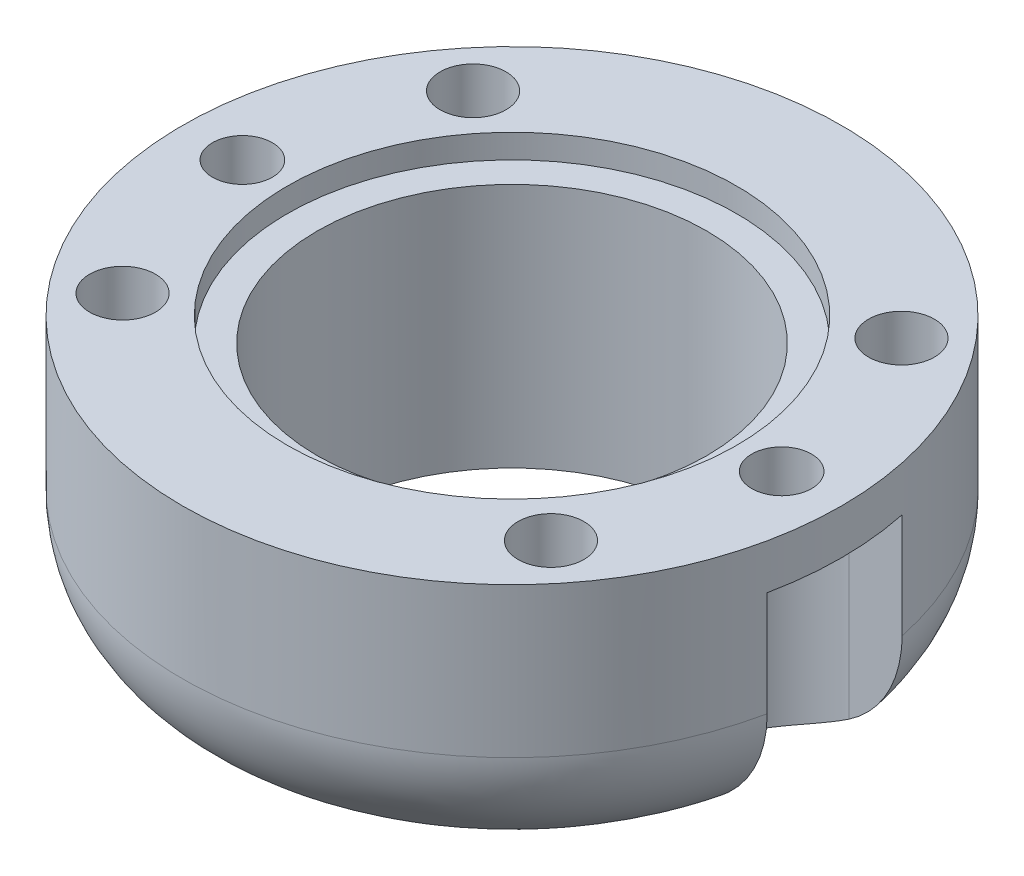
ISO-10303-21;
HEADER;
FILE_DESCRIPTION(('STEP AP214'),'2;1');
FILE_NAME('part.step','',(''),(''),'','','');
FILE_SCHEMA(('AUTOMOTIVE_DESIGN { 1 0 10303 214 1 1 1 1 }'));
ENDSEC;
DATA;
#1=APPLICATION_CONTEXT('core data for automotive mechanical design processes');
#2=APPLICATION_PROTOCOL_DEFINITION('international standard','automotive_design',2000,#1);
#3=PRODUCT_CONTEXT('',#1,'mechanical');
#4=PRODUCT('Part','Part','',(#3));
#5=PRODUCT_RELATED_PRODUCT_CATEGORY('part','',(#4));
#6=PRODUCT_DEFINITION_FORMATION('','',#4);
#7=PRODUCT_DEFINITION_CONTEXT('part definition',#1,'design');
#8=PRODUCT_DEFINITION('design','',#6,#7);
#9=PRODUCT_DEFINITION_SHAPE('','',#8);
#10=(LENGTH_UNIT() NAMED_UNIT(*) SI_UNIT(.MILLI.,.METRE.));
#11=(NAMED_UNIT(*) PLANE_ANGLE_UNIT() SI_UNIT($,.RADIAN.));
#12=(NAMED_UNIT(*) SI_UNIT($,.STERADIAN.) SOLID_ANGLE_UNIT());
#13=UNCERTAINTY_MEASURE_WITH_UNIT(LENGTH_MEASURE(1.E-05),#10,'distance_accuracy_value','');
#14=(GEOMETRIC_REPRESENTATION_CONTEXT(3) GLOBAL_UNCERTAINTY_ASSIGNED_CONTEXT((#13)) GLOBAL_UNIT_ASSIGNED_CONTEXT((#10,
#11,#12)) REPRESENTATION_CONTEXT('',''));
#15=CARTESIAN_POINT('',(0.,0.,0.));
#16=DIRECTION('',(0.,0.,1.));
#17=DIRECTION('',(1.,0.,0.));
#18=AXIS2_PLACEMENT_3D('',#15,#16,#17);
#19=CARTESIAN_POINT('',(0.,9.,0.));
#20=DIRECTION('',(0.,1.,0.));
#21=DIRECTION('',(0.,0.,1.));
#22=AXIS2_PLACEMENT_3D('',#19,#20,#21);
#23=PLANE('',#22);
#24=CARTESIAN_POINT('',(-7.15,9.,-5.85));
#25=DIRECTION('',(0.,1.,0.));
#26=DIRECTION('',(0.,0.,1.));
#27=AXIS2_PLACEMENT_3D('',#24,#25,#26);
#28=CIRCLE('',#27,1.1);
#29=CARTESIAN_POINT('',(-7.15,9.,-4.75));
#30=VERTEX_POINT('',#29);
#31=EDGE_CURVE('E211',#30,#30,#28,.T.);
#32=ORIENTED_EDGE('',*,*,#31,.F.);
#33=EDGE_LOOP('',(#32));
#34=FACE_BOUND('',#33,.T.);
#35=CARTESIAN_POINT('',(-7.15,9.,5.85));
#36=DIRECTION('',(0.,1.,0.));
#37=DIRECTION('',(0.,0.,-1.));
#38=AXIS2_PLACEMENT_3D('',#35,#36,#37);
#39=CIRCLE('',#38,1.1);
#40=CARTESIAN_POINT('',(-7.15,9.,4.75));
#41=VERTEX_POINT('',#40);
#42=EDGE_CURVE('E212',#41,#41,#39,.T.);
#43=ORIENTED_EDGE('',*,*,#42,.F.);
#44=EDGE_LOOP('',(#43));
#45=FACE_BOUND('',#44,.T.);
#46=CARTESIAN_POINT('',(7.15,9.,5.85));
#47=DIRECTION('',(0.,1.,0.));
#48=DIRECTION('',(0.,0.,1.));
#49=AXIS2_PLACEMENT_3D('',#46,#47,#48);
#50=CIRCLE('',#49,1.1);
#51=CARTESIAN_POINT('',(7.15,9.,6.95));
#52=VERTEX_POINT('',#51);
#53=EDGE_CURVE('E220',#52,#52,#50,.T.);
#54=ORIENTED_EDGE('',*,*,#53,.F.);
#55=EDGE_LOOP('',(#54));
#56=FACE_BOUND('',#55,.T.);
#57=CARTESIAN_POINT('',(7.15,9.,-5.85));
#58=DIRECTION('',(0.,1.,0.));
#59=DIRECTION('',(0.,0.,-1.));
#60=AXIS2_PLACEMENT_3D('',#57,#58,#59);
#61=CIRCLE('',#60,1.1);
#62=CARTESIAN_POINT('',(7.15,9.,-6.95));
#63=VERTEX_POINT('',#62);
#64=EDGE_CURVE('E203',#63,#63,#61,.T.);
#65=ORIENTED_EDGE('',*,*,#64,.F.);
#66=EDGE_LOOP('',(#65));
#67=FACE_BOUND('',#66,.T.);
#68=CARTESIAN_POINT('',(9.,9.,0.));
#69=DIRECTION('',(0.,1.,0.));
#70=DIRECTION('',(0.,0.,-1.));
#71=AXIS2_PLACEMENT_3D('',#68,#69,#70);
#72=CIRCLE('',#71,1.);
#73=CARTESIAN_POINT('',(9.,9.,-1.));
#74=VERTEX_POINT('',#73);
#75=EDGE_CURVE('E198',#74,#74,#72,.T.);
#76=ORIENTED_EDGE('',*,*,#75,.F.);
#77=EDGE_LOOP('',(#76));
#78=FACE_BOUND('',#77,.T.);
#79=CARTESIAN_POINT('',(-9.,9.,0.));
#80=DIRECTION('',(0.,1.,0.));
#81=DIRECTION('',(0.,0.,1.));
#82=AXIS2_PLACEMENT_3D('',#79,#80,#81);
#83=CIRCLE('',#82,1.);
#84=CARTESIAN_POINT('',(-9.,9.,1.));
#85=VERTEX_POINT('',#84);
#86=EDGE_CURVE('E199',#85,#85,#83,.T.);
#87=ORIENTED_EDGE('',*,*,#86,.F.);
#88=EDGE_LOOP('',(#87));
#89=FACE_BOUND('',#88,.T.);
#90=CARTESIAN_POINT('',(0.,9.,0.));
#91=DIRECTION('',(0.,1.,0.));
#92=DIRECTION('',(0.,0.,1.));
#93=AXIS2_PLACEMENT_3D('',#90,#91,#92);
#94=CIRCLE('',#93,7.5);
#95=CARTESIAN_POINT('',(0.,9.,7.5));
#96=VERTEX_POINT('',#95);
#97=EDGE_CURVE('E130',#96,#96,#94,.T.);
#98=ORIENTED_EDGE('',*,*,#97,.F.);
#99=EDGE_LOOP('',(#98));
#100=FACE_BOUND('',#99,.T.);
#101=CARTESIAN_POINT('',(0.,9.,0.));
#102=DIRECTION('',(0.,1.,0.));
#103=DIRECTION('',(0.,0.,1.));
#104=AXIS2_PLACEMENT_3D('',#101,#102,#103);
#105=CIRCLE('',#104,11.);
#106=CARTESIAN_POINT('',(0.,9.,11.));
#107=VERTEX_POINT('',#106);
#108=EDGE_CURVE('E242',#107,#107,#105,.T.);
#109=ORIENTED_EDGE('',*,*,#108,.T.);
#110=EDGE_LOOP('',(#109));
#111=FACE_BOUND('',#110,.T.);
#112=ADVANCED_FACE('F40',(#34,#45,#56,#67,#78,#89,#100,#111),#23,.T.);
#113=CARTESIAN_POINT('',(0.,0.,0.));
#114=DIRECTION('',(0.,1.,0.));
#115=DIRECTION('',(0.,0.,1.));
#116=AXIS2_PLACEMENT_3D('',#113,#114,#115);
#117=PLANE('',#116);
#118=CARTESIAN_POINT('',(0.,0.,0.));
#119=DIRECTION('',(0.,1.,0.));
#120=DIRECTION('',(0.,0.,1.));
#121=AXIS2_PLACEMENT_3D('',#118,#119,#120);
#122=CIRCLE('',#121,6.5);
#123=CARTESIAN_POINT('',(0.,0.,6.5));
#124=VERTEX_POINT('',#123);
#125=EDGE_CURVE('E235',#124,#124,#122,.T.);
#126=ORIENTED_EDGE('',*,*,#125,.T.);
#127=EDGE_LOOP('',(#126));
#128=FACE_BOUND('',#127,.T.);
#129=CARTESIAN_POINT('',(-9.,0.,0.));
#130=DIRECTION('',(0.,-1.,0.));
#131=DIRECTION('',(0.,0.,1.));
#132=AXIS2_PLACEMENT_3D('',#129,#130,#131);
#133=CIRCLE('',#132,2.25);
#134=CARTESIAN_POINT('',(-6.94097222222222,0.,-0.907140898835183));
#135=VERTEX_POINT('',#134);
#136=CARTESIAN_POINT('',(-6.94097222222222,0.,0.907140898835183));
#137=VERTEX_POINT('',#136);
#138=EDGE_CURVE('E159',#135,#137,#133,.T.);
#139=ORIENTED_EDGE('',*,*,#138,.F.);
#140=CARTESIAN_POINT('',(0.,0.,0.));
#141=DIRECTION('',(0.,1.,0.));
#142=DIRECTION('',(0.,0.,1.));
#143=AXIS2_PLACEMENT_3D('',#140,#141,#142);
#144=CIRCLE('',#143,7.);
#145=CARTESIAN_POINT('',(6.94097222222222,0.,-0.907140898835181));
#146=VERTEX_POINT('',#145);
#147=EDGE_CURVE('E559',#135,#146,#144,.F.);
#148=ORIENTED_EDGE('',*,*,#147,.T.);
#149=CARTESIAN_POINT('',(9.,0.,0.));
#150=DIRECTION('',(0.,-1.,0.));
#151=DIRECTION('',(0.,0.,-1.));
#152=AXIS2_PLACEMENT_3D('',#149,#150,#151);
#153=CIRCLE('',#152,2.25);
#154=CARTESIAN_POINT('',(6.94097222222222,0.,0.907140898835182));
#155=VERTEX_POINT('',#154);
#156=EDGE_CURVE('E172',#155,#146,#153,.T.);
#157=ORIENTED_EDGE('',*,*,#156,.F.);
#158=CARTESIAN_POINT('',(0.,0.,0.));
#159=DIRECTION('',(0.,1.,0.));
#160=DIRECTION('',(0.,0.,1.));
#161=AXIS2_PLACEMENT_3D('',#158,#159,#160);
#162=CIRCLE('',#161,7.);
#163=EDGE_CURVE('E582',#155,#137,#162,.F.);
#164=ORIENTED_EDGE('',*,*,#163,.T.);
#165=EDGE_LOOP('',(#139,#148,#157,#164));
#166=FACE_BOUND('',#165,.T.);
#167=ADVANCED_FACE('F330',(#128,#166),#117,.F.);
#168=CARTESIAN_POINT('',(-9.,7.5,0.));
#169=DIRECTION('',(0.,1.,0.));
#170=DIRECTION('',(0.,0.,1.));
#171=AXIS2_PLACEMENT_3D('',#168,#169,#170);
#172=PLANE('',#171);
#173=CARTESIAN_POINT('',(-9.,7.5,0.));
#174=DIRECTION('',(0.,1.,0.));
#175=DIRECTION('',(0.,0.,1.));
#176=AXIS2_PLACEMENT_3D('',#173,#174,#175);
#177=CIRCLE('',#176,1.);
#178=CARTESIAN_POINT('',(-9.,7.5,1.));
#179=VERTEX_POINT('',#178);
#180=EDGE_CURVE('E142',#179,#179,#177,.F.);
#181=ORIENTED_EDGE('',*,*,#180,.F.);
#182=EDGE_LOOP('',(#181));
#183=FACE_BOUND('',#182,.T.);
#184=CARTESIAN_POINT('',(0.,7.5,0.));
#185=DIRECTION('',(0.,1.,0.));
#186=DIRECTION('',(0.,0.,1.));
#187=AXIS2_PLACEMENT_3D('',#184,#185,#186);
#188=CIRCLE('',#187,11.);
#189=CARTESIAN_POINT('',(-10.767427733679,7.5,-2.25));
#190=VERTEX_POINT('',#189);
#191=CARTESIAN_POINT('',(-10.767427733679,7.5,2.25));
#192=VERTEX_POINT('',#191);
#193=EDGE_CURVE('E127',#190,#192,#188,.T.);
#194=ORIENTED_EDGE('',*,*,#193,.F.);
#195=DIRECTION('',(1.,0.,0.));
#196=VECTOR('',#195,1.);
#197=CARTESIAN_POINT('',(-9.,7.5,-2.25));
#198=LINE('',#197,#196);
#199=CARTESIAN_POINT('',(-9.,7.5,-2.25));
#200=VERTEX_POINT('',#199);
#201=EDGE_CURVE('E137',#190,#200,#198,.T.);
#202=ORIENTED_EDGE('',*,*,#201,.T.);
#203=CARTESIAN_POINT('',(-9.,7.5,0.));
#204=DIRECTION('',(0.,-1.,0.));
#205=DIRECTION('',(0.,0.,1.));
#206=AXIS2_PLACEMENT_3D('',#203,#204,#205);
#207=CIRCLE('',#206,2.25);
#208=CARTESIAN_POINT('',(-9.,7.5,2.25));
#209=VERTEX_POINT('',#208);
#210=EDGE_CURVE('E155',#200,#209,#207,.T.);
#211=ORIENTED_EDGE('',*,*,#210,.T.);
#212=DIRECTION('',(-1.,0.,0.));
#213=VECTOR('',#212,1.);
#214=CARTESIAN_POINT('',(-9.,7.5,2.25));
#215=LINE('',#214,#213);
#216=EDGE_CURVE('E139',#209,#192,#215,.T.);
#217=ORIENTED_EDGE('',*,*,#216,.T.);
#218=EDGE_LOOP('',(#194,#202,#211,#217));
#219=FACE_BOUND('',#218,.T.);
#220=ADVANCED_FACE('F135',(#183,#219),#172,.F.);
#221=CARTESIAN_POINT('',(-9.,7.5,-2.25));
#222=DIRECTION('',(0.,0.,-1.));
#223=DIRECTION('',(-1.,0.,0.));
#224=AXIS2_PLACEMENT_3D('',#221,#222,#223);
#225=PLANE('',#224);
#226=DIRECTION('',(0.,-1.,0.));
#227=VECTOR('',#226,1.);
#228=CARTESIAN_POINT('',(-10.767427733679,10.,-2.25));
#229=LINE('',#228,#227);
#230=CARTESIAN_POINT('',(-10.767427733679,4.,-2.25));
#231=VERTEX_POINT('',#230);
#232=EDGE_CURVE('E122',#231,#190,#229,.F.);
#233=ORIENTED_EDGE('',*,*,#232,.F.);
#234=CARTESIAN_POINT('',(-10.767427733679,4.,-2.25));
#235=CARTESIAN_POINT('',(-10.7674396072827,3.88937292476482,-2.25));
#236=CARTESIAN_POINT('',(-10.7627393881199,3.77875108381293,-2.25));
#237=CARTESIAN_POINT('',(-10.7440055240954,3.55830825916038,-2.25));
#238=CARTESIAN_POINT('',(-10.7299725521976,3.44848721829301,-2.25));
#239=CARTESIAN_POINT('',(-10.6927028884498,3.23064798338886,-2.25));
#240=CARTESIAN_POINT('',(-10.6694854850848,3.12262650235743,-2.25));
#241=CARTESIAN_POINT('',(-10.6140464855373,2.90894932622838,-2.25));
#242=CARTESIAN_POINT('',(-10.5818250087945,2.80329359976896,-2.25));
#243=CARTESIAN_POINT('',(-10.4719433816605,2.49086823827501,-2.25));
#244=CARTESIAN_POINT('',(-10.3810572288438,2.28858934429225,-2.25));
#245=CARTESIAN_POINT('',(-10.1667674400757,1.90201532512651,-2.25));
#246=CARTESIAN_POINT('',(-10.0433566307383,1.71772417948424,-2.25));
#247=CARTESIAN_POINT('',(-9.84151806339658,1.46450442934,-2.25));
#248=CARTESIAN_POINT('',(-9.77421789981565,1.38648382286098,-2.25));
#249=CARTESIAN_POINT('',(-9.63380145676216,1.23583337366697,-2.25));
#250=CARTESIAN_POINT('',(-9.56068529922734,1.16320341799364,-2.25));
#251=CARTESIAN_POINT('',(-9.40909727902006,1.02374663332172,-2.25));
#252=CARTESIAN_POINT('',(-9.33062435344717,0.956920962033146,-2.25));
#253=CARTESIAN_POINT('',(-9.16882761687672,0.829425994445518,-2.25));
#254=CARTESIAN_POINT('',(-9.08550384089006,0.768756653721947,-2.25));
#255=CARTESIAN_POINT('',(-9.,0.711333521477694,-2.25));
#256=B_SPLINE_CURVE_WITH_KNOTS('',3,(#234,#235,#236,#237,#238,#239,#240,#241,#242,#243,#244,
#245,#246,#247,#248,#249,#250,#251,#252,#253,#254,#255),.UNSPECIFIED.,.F.,.F.,(4,2,2,2,2,2,2,2,
2,2,4),(0.,0.331772170767974,0.663520420784995,0.994575624526256,1.32562643700634,
1.98757455085098,2.64966878119285,2.95853123327302,3.26738721146888,3.57630465261721,
3.88521986443671),.UNSPECIFIED.);
#257=CARTESIAN_POINT('',(-9.,0.711333521477693,-2.25));
#258=VERTEX_POINT('',#257);
#259=EDGE_CURVE('E55',#231,#258,#256,.T.);
#260=ORIENTED_EDGE('',*,*,#259,.T.);
#261=DIRECTION('',(0.,-1.,0.));
#262=VECTOR('',#261,1.);
#263=CARTESIAN_POINT('',(-9.,7.5,-2.25));
#264=LINE('',#263,#262);
#265=EDGE_CURVE('E145',#200,#258,#264,.T.);
#266=ORIENTED_EDGE('',*,*,#265,.F.);
#267=ORIENTED_EDGE('',*,*,#201,.F.);
#268=EDGE_LOOP('',(#233,#260,#266,#267));
#269=FACE_BOUND('',#268,.T.);
#270=ADVANCED_FACE('F144',(#269),#225,.F.);
#271=CARTESIAN_POINT('',(9.,7.5,0.));
#272=DIRECTION('',(0.,-1.,0.));
#273=DIRECTION('',(0.,0.,-1.));
#274=AXIS2_PLACEMENT_3D('',#271,#272,#273);
#275=PLANE('',#274);
#276=CARTESIAN_POINT('',(9.,7.5,0.));
#277=DIRECTION('',(0.,-1.,0.));
#278=DIRECTION('',(0.,0.,-1.));
#279=AXIS2_PLACEMENT_3D('',#276,#277,#278);
#280=CIRCLE('',#279,1.);
#281=CARTESIAN_POINT('',(9.,7.5,-1.));
#282=VERTEX_POINT('',#281);
#283=EDGE_CURVE('E141',#282,#282,#280,.F.);
#284=ORIENTED_EDGE('',*,*,#283,.T.);
#285=EDGE_LOOP('',(#284));
#286=FACE_BOUND('',#285,.T.);
#287=DIRECTION('',(1.,0.,0.));
#288=VECTOR('',#287,1.);
#289=CARTESIAN_POINT('',(9.,7.5,-2.25));
#290=LINE('',#289,#288);
#291=CARTESIAN_POINT('',(9.,7.5,-2.25));
#292=VERTEX_POINT('',#291);
#293=CARTESIAN_POINT('',(10.767427733679,7.5,-2.25));
#294=VERTEX_POINT('',#293);
#295=EDGE_CURVE('E176',#292,#294,#290,.T.);
#296=ORIENTED_EDGE('',*,*,#295,.T.);
#297=CARTESIAN_POINT('',(0.,7.5,0.));
#298=DIRECTION('',(0.,-1.,0.));
#299=DIRECTION('',(0.,0.,-1.));
#300=AXIS2_PLACEMENT_3D('',#297,#298,#299);
#301=CIRCLE('',#300,11.);
#302=CARTESIAN_POINT('',(10.767427733679,7.5,2.25));
#303=VERTEX_POINT('',#302);
#304=EDGE_CURVE('E195',#294,#303,#301,.T.);
#305=ORIENTED_EDGE('',*,*,#304,.T.);
#306=DIRECTION('',(-1.,0.,0.));
#307=VECTOR('',#306,1.);
#308=CARTESIAN_POINT('',(9.,7.5,2.25));
#309=LINE('',#308,#307);
#310=CARTESIAN_POINT('',(9.,7.5,2.25));
#311=VERTEX_POINT('',#310);
#312=EDGE_CURVE('E167',#303,#311,#309,.T.);
#313=ORIENTED_EDGE('',*,*,#312,.T.);
#314=CARTESIAN_POINT('',(9.,7.5,0.));
#315=DIRECTION('',(0.,-1.,0.));
#316=DIRECTION('',(0.,0.,-1.));
#317=AXIS2_PLACEMENT_3D('',#314,#315,#316);
#318=CIRCLE('',#317,2.25);
#319=EDGE_CURVE('E171',#311,#292,#318,.T.);
#320=ORIENTED_EDGE('',*,*,#319,.T.);
#321=EDGE_LOOP('',(#296,#305,#313,#320));
#322=FACE_BOUND('',#321,.T.);
#323=ADVANCED_FACE('F463',(#286,#322),#275,.T.);
#324=CARTESIAN_POINT('',(9.,7.5,-2.25));
#325=DIRECTION('',(0.,0.,-1.));
#326=DIRECTION('',(-1.,0.,0.));
#327=AXIS2_PLACEMENT_3D('',#324,#325,#326);
#328=PLANE('',#327);
#329=DIRECTION('',(0.,-1.,0.));
#330=VECTOR('',#329,1.);
#331=CARTESIAN_POINT('',(9.,7.5,-2.25));
#332=LINE('',#331,#330);
#333=CARTESIAN_POINT('',(9.,0.711333521477693,-2.25));
#334=VERTEX_POINT('',#333);
#335=EDGE_CURVE('E162',#292,#334,#332,.T.);
#336=ORIENTED_EDGE('',*,*,#335,.T.);
#337=CARTESIAN_POINT('',(9.,0.711333521477693,-2.25));
#338=CARTESIAN_POINT('',(9.0935506508423,0.774155673397265,-2.25));
#339=CARTESIAN_POINT('',(9.18449151615389,0.840871032591709,-2.25));
#340=CARTESIAN_POINT('',(9.3605167874961,0.981638009233439,-2.25));
#341=CARTESIAN_POINT('',(9.44560074067041,1.05569019288643,-2.25));
#342=CARTESIAN_POINT('',(9.60921846839757,1.2106308727483,-2.25));
#343=CARTESIAN_POINT('',(9.68775559683252,1.29151582529287,-2.25));
#344=CARTESIAN_POINT('',(9.83773017946922,1.4596132400955,-2.25));
#345=CARTESIAN_POINT('',(9.90916801273694,1.54682536408441,-2.25));
#346=CARTESIAN_POINT('',(10.0444836591969,1.72710278381938,-2.25));
#347=CARTESIAN_POINT('',(10.108351912435,1.82017525852865,-2.25));
#348=CARTESIAN_POINT('',(10.2279490640232,2.0114576636892,-2.25));
#349=CARTESIAN_POINT('',(10.2836749093055,2.10966950253993,-2.25));
#350=CARTESIAN_POINT('',(10.3864679781662,2.31040636861586,-2.25));
#351=CARTESIAN_POINT('',(10.4335441191574,2.41292681832422,-2.25));
#352=CARTESIAN_POINT('',(10.5187463569906,2.62162884604041,-2.25));
#353=CARTESIAN_POINT('',(10.5568693303643,2.72781168696474,-2.25));
#354=CARTESIAN_POINT('',(10.6488379722109,3.02350254699599,-2.25));
#355=CARTESIAN_POINT('',(10.6932056946452,3.21609506160447,-2.25));
#356=CARTESIAN_POINT('',(10.7376802186749,3.50821666970632,-2.25));
#357=CARTESIAN_POINT('',(10.7488256100361,3.60621793454539,-2.25));
#358=CARTESIAN_POINT('',(10.7636983450552,3.80279617120706,-2.25));
#359=CARTESIAN_POINT('',(10.7674246119724,3.9013732245123,-2.25));
#360=CARTESIAN_POINT('',(10.767427733679,4.,-2.25));
#361=B_SPLINE_CURVE_WITH_KNOTS('',3,(#337,#338,#339,#340,#341,#342,#343,#344,#345,#346,#347,
#348,#349,#350,#351,#352,#353,#354,#355,#356,#357,#358,#359,#360),.UNSPECIFIED.,.F.,.F.,(4,2,2,
2,2,2,2,2,2,2,2,4),(0.,0.337970383020635,0.675966868619565,1.01378912355532,1.35159333081247,
1.68981971944249,2.02817260538284,2.36617468481135,2.70429450755391,3.29457802683463,
3.59024609755595,3.88595707558647),.UNSPECIFIED.);
#362=CARTESIAN_POINT('',(10.767427733679,4.,-2.25));
#363=VERTEX_POINT('',#362);
#364=EDGE_CURVE('E527',#334,#363,#361,.T.);
#365=ORIENTED_EDGE('',*,*,#364,.T.);
#366=DIRECTION('',(0.,-1.,0.));
#367=VECTOR('',#366,1.);
#368=CARTESIAN_POINT('',(10.767427733679,10.,-2.25));
#369=LINE('',#368,#367);
#370=EDGE_CURVE('E131',#294,#363,#369,.T.);
#371=ORIENTED_EDGE('',*,*,#370,.F.);
#372=ORIENTED_EDGE('',*,*,#295,.F.);
#373=EDGE_LOOP('',(#336,#365,#371,#372));
#374=FACE_BOUND('',#373,.T.);
#375=ADVANCED_FACE('F326',(#374),#328,.F.);
#376=CARTESIAN_POINT('',(0.,9.,0.));
#377=DIRECTION('',(0.,-1.,0.));
#378=DIRECTION('',(0.,0.,-1.));
#379=AXIS2_PLACEMENT_3D('',#376,#377,#378);
#380=CYLINDRICAL_SURFACE('',#379,6.5);
#381=ORIENTED_EDGE('',*,*,#125,.F.);
#382=EDGE_LOOP('',(#381));
#383=FACE_BOUND('',#382,.T.);
#384=CARTESIAN_POINT('',(0.,8.2,0.));
#385=DIRECTION('',(0.,1.,0.));
#386=DIRECTION('',(0.,0.,1.));
#387=AXIS2_PLACEMENT_3D('',#384,#385,#386);
#388=CIRCLE('',#387,6.5);
#389=CARTESIAN_POINT('',(0.,8.2,6.5));
#390=VERTEX_POINT('',#389);
#391=EDGE_CURVE('E184',#390,#390,#388,.T.);
#392=ORIENTED_EDGE('',*,*,#391,.T.);
#393=EDGE_LOOP('',(#392));
#394=FACE_BOUND('',#393,.T.);
#395=ADVANCED_FACE('F291',(#383,#394),#380,.F.);
#396=CARTESIAN_POINT('',(9.,-11.,0.));
#397=DIRECTION('',(0.,1.,0.));
#398=DIRECTION('',(0.,0.,1.));
#399=AXIS2_PLACEMENT_3D('',#396,#397,#398);
#400=CYLINDRICAL_SURFACE('',#399,1.);
#401=ORIENTED_EDGE('',*,*,#75,.T.);
#402=EDGE_LOOP('',(#401));
#403=FACE_BOUND('',#402,.T.);
#404=ORIENTED_EDGE('',*,*,#283,.F.);
#405=EDGE_LOOP('',(#404));
#406=FACE_BOUND('',#405,.T.);
#407=ADVANCED_FACE('F288',(#403,#406),#400,.F.);
#408=CARTESIAN_POINT('',(0.,9.,0.));
#409=DIRECTION('',(0.,-1.,0.));
#410=DIRECTION('',(0.,0.,-1.));
#411=AXIS2_PLACEMENT_3D('',#408,#409,#410);
#412=CYLINDRICAL_SURFACE('',#411,11.);
#413=ORIENTED_EDGE('',*,*,#370,.T.);
#414=CARTESIAN_POINT('',(0.,4.,0.));
#415=DIRECTION('',(0.,1.,0.));
#416=DIRECTION('',(0.,0.,1.));
#417=AXIS2_PLACEMENT_3D('',#414,#415,#416);
#418=CIRCLE('',#417,11.);
#419=EDGE_CURVE('E69',#363,#231,#418,.T.);
#420=ORIENTED_EDGE('',*,*,#419,.T.);
#421=ORIENTED_EDGE('',*,*,#232,.T.);
#422=ORIENTED_EDGE('',*,*,#193,.T.);
#423=DIRECTION('',(0.,-1.,0.));
#424=VECTOR('',#423,1.);
#425=CARTESIAN_POINT('',(-10.767427733679,7.5,2.25));
#426=LINE('',#425,#424);
#427=CARTESIAN_POINT('',(-10.767427733679,4.,2.25));
#428=VERTEX_POINT('',#427);
#429=EDGE_CURVE('E153',#192,#428,#426,.T.);
#430=ORIENTED_EDGE('',*,*,#429,.T.);
#431=CARTESIAN_POINT('',(0.,4.,0.));
#432=DIRECTION('',(0.,1.,0.));
#433=DIRECTION('',(0.,0.,1.));
#434=AXIS2_PLACEMENT_3D('',#431,#432,#433);
#435=CIRCLE('',#434,11.);
#436=CARTESIAN_POINT('',(10.767427733679,4.,2.25));
#437=VERTEX_POINT('',#436);
#438=EDGE_CURVE('E246',#428,#437,#435,.T.);
#439=ORIENTED_EDGE('',*,*,#438,.T.);
#440=DIRECTION('',(0.,-1.,0.));
#441=VECTOR('',#440,1.);
#442=CARTESIAN_POINT('',(10.767427733679,7.5,2.25));
#443=LINE('',#442,#441);
#444=EDGE_CURVE('E180',#303,#437,#443,.T.);
#445=ORIENTED_EDGE('',*,*,#444,.F.);
#446=ORIENTED_EDGE('',*,*,#304,.F.);
#447=EDGE_LOOP('',(#413,#420,#421,#422,#430,#439,#445,#446));
#448=FACE_BOUND('',#447,.T.);
#449=ORIENTED_EDGE('',*,*,#108,.F.);
#450=EDGE_LOOP('',(#449));
#451=FACE_BOUND('',#450,.T.);
#452=ADVANCED_FACE('F124',(#448,#451),#412,.T.);
#453=CARTESIAN_POINT('',(-7.15,6.,-5.85));
#454=DIRECTION('',(0.,1.,0.));
#455=DIRECTION('',(0.,0.,1.));
#456=AXIS2_PLACEMENT_3D('',#453,#454,#455);
#457=CYLINDRICAL_SURFACE('',#456,1.1);
#458=CARTESIAN_POINT('',(-7.15,6.,-5.85));
#459=DIRECTION('',(0.,1.,0.));
#460=DIRECTION('',(0.,0.,1.));
#461=AXIS2_PLACEMENT_3D('',#458,#459,#460);
#462=CIRCLE('',#461,1.1);
#463=CARTESIAN_POINT('',(-7.15,6.,-4.75));
#464=VERTEX_POINT('',#463);
#465=EDGE_CURVE('E231',#464,#464,#462,.T.);
#466=ORIENTED_EDGE('',*,*,#465,.F.);
#467=EDGE_LOOP('',(#466));
#468=FACE_BOUND('',#467,.T.);
#469=ORIENTED_EDGE('',*,*,#31,.T.);
#470=EDGE_LOOP('',(#469));
#471=FACE_BOUND('',#470,.T.);
#472=ADVANCED_FACE('F319',(#468,#471),#457,.F.);
#473=CARTESIAN_POINT('',(-7.15,6.,-5.85));
#474=DIRECTION('',(0.,1.,0.));
#475=DIRECTION('',(0.,0.,1.));
#476=AXIS2_PLACEMENT_3D('',#473,#474,#475);
#477=PLANE('',#476);
#478=ORIENTED_EDGE('',*,*,#465,.T.);
#479=EDGE_LOOP('',(#478));
#480=FACE_BOUND('',#479,.T.);
#481=ADVANCED_FACE('F301',(#480),#477,.T.);
#482=CARTESIAN_POINT('',(-7.15,6.,5.85));
#483=DIRECTION('',(0.,1.,0.));
#484=DIRECTION('',(0.,0.,1.));
#485=AXIS2_PLACEMENT_3D('',#482,#483,#484);
#486=CYLINDRICAL_SURFACE('',#485,1.1);
#487=CARTESIAN_POINT('',(-7.15,6.,5.85));
#488=DIRECTION('',(0.,1.,0.));
#489=DIRECTION('',(0.,0.,-1.));
#490=AXIS2_PLACEMENT_3D('',#487,#488,#489);
#491=CIRCLE('',#490,1.1);
#492=CARTESIAN_POINT('',(-7.15,6.,4.75));
#493=VERTEX_POINT('',#492);
#494=EDGE_CURVE('E207',#493,#493,#491,.T.);
#495=ORIENTED_EDGE('',*,*,#494,.F.);
#496=EDGE_LOOP('',(#495));
#497=FACE_BOUND('',#496,.T.);
#498=ORIENTED_EDGE('',*,*,#42,.T.);
#499=EDGE_LOOP('',(#498));
#500=FACE_BOUND('',#499,.T.);
#501=ADVANCED_FACE('F297',(#497,#500),#486,.F.);
#502=CARTESIAN_POINT('',(-7.15,6.,5.85));
#503=DIRECTION('',(0.,-1.,0.));
#504=DIRECTION('',(0.,0.,-1.));
#505=AXIS2_PLACEMENT_3D('',#502,#503,#504);
#506=PLANE('',#505);
#507=ORIENTED_EDGE('',*,*,#494,.T.);
#508=EDGE_LOOP('',(#507));
#509=FACE_BOUND('',#508,.T.);
#510=ADVANCED_FACE('F293',(#509),#506,.F.);
#511=CARTESIAN_POINT('',(7.15,6.,5.85));
#512=DIRECTION('',(0.,1.,0.));
#513=DIRECTION('',(0.,0.,1.));
#514=AXIS2_PLACEMENT_3D('',#511,#512,#513);
#515=CYLINDRICAL_SURFACE('',#514,1.1);
#516=CARTESIAN_POINT('',(7.15,6.,5.85));
#517=DIRECTION('',(0.,1.,0.));
#518=DIRECTION('',(0.,0.,1.));
#519=AXIS2_PLACEMENT_3D('',#516,#517,#518);
#520=CIRCLE('',#519,1.1);
#521=CARTESIAN_POINT('',(7.15,6.,6.95));
#522=VERTEX_POINT('',#521);
#523=EDGE_CURVE('E216',#522,#522,#520,.T.);
#524=ORIENTED_EDGE('',*,*,#523,.F.);
#525=EDGE_LOOP('',(#524));
#526=FACE_BOUND('',#525,.T.);
#527=ORIENTED_EDGE('',*,*,#53,.T.);
#528=EDGE_LOOP('',(#527));
#529=FACE_BOUND('',#528,.T.);
#530=ADVANCED_FACE('F296',(#526,#529),#515,.F.);
#531=CARTESIAN_POINT('',(7.15,6.,5.85));
#532=DIRECTION('',(0.,1.,0.));
#533=DIRECTION('',(0.,0.,1.));
#534=AXIS2_PLACEMENT_3D('',#531,#532,#533);
#535=PLANE('',#534);
#536=ORIENTED_EDGE('',*,*,#523,.T.);
#537=EDGE_LOOP('',(#536));
#538=FACE_BOUND('',#537,.T.);
#539=ADVANCED_FACE('F303',(#538),#535,.T.);
#540=CARTESIAN_POINT('',(7.15,6.,-5.85));
#541=DIRECTION('',(0.,1.,0.));
#542=DIRECTION('',(0.,0.,1.));
#543=AXIS2_PLACEMENT_3D('',#540,#541,#542);
#544=CYLINDRICAL_SURFACE('',#543,1.1);
#545=CARTESIAN_POINT('',(7.15,6.,-5.85));
#546=DIRECTION('',(0.,1.,0.));
#547=DIRECTION('',(0.,0.,-1.));
#548=AXIS2_PLACEMENT_3D('',#545,#546,#547);
#549=CIRCLE('',#548,1.1);
#550=CARTESIAN_POINT('',(7.15,6.,-6.95));
#551=VERTEX_POINT('',#550);
#552=EDGE_CURVE('E224',#551,#551,#549,.T.);
#553=ORIENTED_EDGE('',*,*,#552,.F.);
#554=EDGE_LOOP('',(#553));
#555=FACE_BOUND('',#554,.T.);
#556=ORIENTED_EDGE('',*,*,#64,.T.);
#557=EDGE_LOOP('',(#556));
#558=FACE_BOUND('',#557,.T.);
#559=ADVANCED_FACE('F306',(#555,#558),#544,.F.);
#560=CARTESIAN_POINT('',(7.15,6.,-5.85));
#561=DIRECTION('',(0.,-1.,0.));
#562=DIRECTION('',(0.,0.,-1.));
#563=AXIS2_PLACEMENT_3D('',#560,#561,#562);
#564=PLANE('',#563);
#565=ORIENTED_EDGE('',*,*,#552,.T.);
#566=EDGE_LOOP('',(#565));
#567=FACE_BOUND('',#566,.T.);
#568=ADVANCED_FACE('F286',(#567),#564,.F.);
#569=CARTESIAN_POINT('',(-9.,-11.,0.));
#570=DIRECTION('',(0.,1.,0.));
#571=DIRECTION('',(0.,0.,1.));
#572=AXIS2_PLACEMENT_3D('',#569,#570,#571);
#573=CYLINDRICAL_SURFACE('',#572,1.);
#574=ORIENTED_EDGE('',*,*,#180,.T.);
#575=EDGE_LOOP('',(#574));
#576=FACE_BOUND('',#575,.T.);
#577=ORIENTED_EDGE('',*,*,#86,.T.);
#578=EDGE_LOOP('',(#577));
#579=FACE_BOUND('',#578,.T.);
#580=ADVANCED_FACE('F282',(#576,#579),#573,.F.);
#581=CARTESIAN_POINT('',(-9.,7.5,0.));
#582=DIRECTION('',(0.,-1.,0.));
#583=DIRECTION('',(0.,0.,-1.));
#584=AXIS2_PLACEMENT_3D('',#581,#582,#583);
#585=CYLINDRICAL_SURFACE('',#584,2.25);
#586=ORIENTED_EDGE('',*,*,#265,.T.);
#587=CARTESIAN_POINT('',(-9.,0.711333521477693,-2.25));
#588=CARTESIAN_POINT('',(-8.94593790490455,0.675013950951578,-2.25000241726609));
#589=CARTESIAN_POINT('',(-8.89113687250343,0.63975849092983,-2.2480508216919));
#590=CARTESIAN_POINT('',(-8.78034751449976,0.571568054524197,-2.23994176914327));
#591=CARTESIAN_POINT('',(-8.72435813622643,0.538635257639475,-2.23378041833288));
#592=CARTESIAN_POINT('',(-8.61126544078718,0.475171712197558,-2.21690537570656));
#593=CARTESIAN_POINT('',(-8.55415761673907,0.444655589095544,-2.20616615567283));
#594=CARTESIAN_POINT('',(-8.43963172363864,0.386476866935103,-2.17989587130921));
#595=CARTESIAN_POINT('',(-8.38221374792904,0.358813454749132,-2.16436617750601));
#596=CARTESIAN_POINT('',(-8.20953329174098,0.280105005434506,-2.11003031833623));
#597=CARTESIAN_POINT('',(-8.09441626253259,0.233661919125878,-2.06355624565092));
#598=CARTESIAN_POINT('',(-7.87036120645417,0.154448211174015,-1.94990479492616));
#599=CARTESIAN_POINT('',(-7.76140297977309,0.121630345850737,-1.88280038313981));
#600=CARTESIAN_POINT('',(-7.56614357237481,0.0719642005334553,-1.73772330038436));
#601=CARTESIAN_POINT('',(-7.478669962433,0.0537474837518619,-1.66178427956518));
#602=CARTESIAN_POINT('',(-7.31571840253817,0.0261361976350542,-1.49638829910681));
#603=CARTESIAN_POINT('',(-7.24025589923907,0.0167529134009563,-1.40691421665221));
#604=CARTESIAN_POINT('',(-7.12670973819618,0.00651440104618007,-1.24874971143984));
#605=CARTESIAN_POINT('',(-7.08454148088777,0.00386079370071692,-1.1830437098153));
#606=CARTESIAN_POINT('',(-7.00735388058145,0.000608820862548747,-1.04781221263155));
#607=CARTESIAN_POINT('',(-6.97231006989829,3.30551097920933E-06,-0.978300867128612));
#608=CARTESIAN_POINT('',(-6.94097222222222,0.,-0.907140898835184));
#609=B_SPLINE_CURVE_WITH_KNOTS('',3,(#587,#588,#589,#590,#591,#592,#593,#594,#595,#596,#597,
#598,#599,#600,#601,#602,#603,#604,#605,#606,#607,#608),.UNSPECIFIED.,.F.,.F.,(4,2,2,2,2,2,2,2,
2,2,4),(0.,0.195374236196524,0.390929429930828,0.587589692721366,0.784193744254847,
1.17935545661586,1.5731353173627,1.9231982791349,2.27370785733927,2.50764522199115,
2.74076506715901),.UNSPECIFIED.);
#610=EDGE_CURVE('E12',#258,#135,#609,.T.);
#611=ORIENTED_EDGE('',*,*,#610,.T.);
#612=ORIENTED_EDGE('',*,*,#138,.T.);
#613=CARTESIAN_POINT('',(-6.94097222222222,0.,0.907140898835183));
#614=CARTESIAN_POINT('',(-6.964901658015,1.11121898225679E-06,0.96147101787388));
#615=CARTESIAN_POINT('',(-6.99099401928906,0.000354770708900366,1.0148524388197));
#616=CARTESIAN_POINT('',(-7.04731323758979,0.0021359963173338,1.11938995726066));
#617=CARTESIAN_POINT('',(-7.07754140986135,0.00356390471427327,1.17054533999638));
#618=CARTESIAN_POINT('',(-7.14197857546951,0.00786645924308113,1.27035016475928));
#619=CARTESIAN_POINT('',(-7.17619406380053,0.0107434919249358,1.31899532655497));
#620=CARTESIAN_POINT('',(-7.24827420629185,0.0182916418912106,1.41332472180342));
#621=CARTESIAN_POINT('',(-7.28613839047789,0.0229625283470982,1.45900933532838));
#622=CARTESIAN_POINT('',(-7.40499379148071,0.040200752957204,1.59138138752629));
#623=CARTESIAN_POINT('',(-7.49111835291866,0.0559878682506792,1.67318716531904));
#624=CARTESIAN_POINT('',(-7.67335133545162,0.0979525227559025,1.82106065537824));
#625=CARTESIAN_POINT('',(-7.76943795329234,0.124107710342301,1.88716173694152));
#626=CARTESIAN_POINT('',(-7.96353245477822,0.186077950767692,2.00007390071858));
#627=CARTESIAN_POINT('',(-8.06127816487974,0.221427055616934,2.04759475668574));
#628=CARTESIAN_POINT('',(-8.25921767934427,0.301925206221067,2.12724247444521));
#629=CARTESIAN_POINT('',(-8.35941669443118,0.347097074526505,2.15933291752454));
#630=CARTESIAN_POINT('',(-8.55142433658781,0.442421057296468,2.20687746872741));
#631=CARTESIAN_POINT('',(-8.64328971341488,0.491930014409718,2.2234142944092));
#632=CARTESIAN_POINT('',(-8.77896750019176,0.570919790718834,2.23957835574309));
#633=CARTESIAN_POINT('',(-8.82374378677248,0.597972724568884,2.24352691616727));
#634=CARTESIAN_POINT('',(-8.91249978356166,0.653563357232496,2.24873671684499));
#635=CARTESIAN_POINT('',(-8.95647982199332,0.682100424574308,2.24999909059267));
#636=CARTESIAN_POINT('',(-9.,0.711333521477693,2.25));
#637=B_SPLINE_CURVE_WITH_KNOTS('',3,(#613,#614,#615,#616,#617,#618,#619,#620,#621,#622,#623,
#624,#625,#626,#627,#628,#629,#630,#631,#632,#633,#634,#635,#636),.UNSPECIFIED.,.F.,.F.,(4,2,2,
2,2,2,2,2,2,2,2,4),(0.,0.178056767561219,0.356170291814715,0.534578113483165,0.71296298577544,
1.0704380975926,1.42714671484207,1.76845060880219,2.11055613841113,2.42655360095662,
2.5838612066767,2.74110241990154),.UNSPECIFIED.);
#638=CARTESIAN_POINT('',(-9.,0.711333521477693,2.25));
#639=VERTEX_POINT('',#638);
#640=EDGE_CURVE('E560',#137,#639,#637,.T.);
#641=ORIENTED_EDGE('',*,*,#640,.T.);
#642=DIRECTION('',(0.,-1.,0.));
#643=VECTOR('',#642,1.);
#644=CARTESIAN_POINT('',(-9.,7.5,2.25));
#645=LINE('',#644,#643);
#646=EDGE_CURVE('E148',#209,#639,#645,.T.);
#647=ORIENTED_EDGE('',*,*,#646,.F.);
#648=ORIENTED_EDGE('',*,*,#210,.F.);
#649=EDGE_LOOP('',(#586,#611,#612,#641,#647,#648));
#650=FACE_BOUND('',#649,.T.);
#651=ADVANCED_FACE('F285',(#650),#585,.F.);
#652=CARTESIAN_POINT('',(-9.,7.5,2.25));
#653=DIRECTION('',(0.,0.,1.));
#654=DIRECTION('',(1.,0.,0.));
#655=AXIS2_PLACEMENT_3D('',#652,#653,#654);
#656=PLANE('',#655);
#657=ORIENTED_EDGE('',*,*,#646,.T.);
#658=CARTESIAN_POINT('',(-9.,0.711333521477693,2.25));
#659=CARTESIAN_POINT('',(-9.0935506508423,0.774155673397265,2.25));
#660=CARTESIAN_POINT('',(-9.18449151615389,0.840871032591708,2.25));
#661=CARTESIAN_POINT('',(-9.3605167874961,0.981638009233438,2.25));
#662=CARTESIAN_POINT('',(-9.44560074067041,1.05569019288643,2.25));
#663=CARTESIAN_POINT('',(-9.60921846839757,1.2106308727483,2.25));
#664=CARTESIAN_POINT('',(-9.68775559683252,1.29151582529287,2.25));
#665=CARTESIAN_POINT('',(-9.83773017946922,1.4596132400955,2.25));
#666=CARTESIAN_POINT('',(-9.90916801273694,1.54682536408441,2.25));
#667=CARTESIAN_POINT('',(-10.0444836591969,1.72710278381938,2.25));
#668=CARTESIAN_POINT('',(-10.108351912435,1.82017525852865,2.25));
#669=CARTESIAN_POINT('',(-10.2279490640232,2.0114576636892,2.25));
#670=CARTESIAN_POINT('',(-10.2836749093055,2.10966950253993,2.25));
#671=CARTESIAN_POINT('',(-10.3864679781662,2.31040636861586,2.25));
#672=CARTESIAN_POINT('',(-10.4335441191574,2.41292681832422,2.25));
#673=CARTESIAN_POINT('',(-10.5187463569906,2.62162884604041,2.25));
#674=CARTESIAN_POINT('',(-10.5568693303643,2.72781168696474,2.25));
#675=CARTESIAN_POINT('',(-10.6488379722109,3.02350254699599,2.25));
#676=CARTESIAN_POINT('',(-10.6932056946452,3.21609506160447,2.25));
#677=CARTESIAN_POINT('',(-10.7376802186749,3.50821666970632,2.25));
#678=CARTESIAN_POINT('',(-10.7488256100361,3.60621793454539,2.25));
#679=CARTESIAN_POINT('',(-10.7636983450552,3.80279617120706,2.25));
#680=CARTESIAN_POINT('',(-10.7674246119724,3.9013732245123,2.25));
#681=CARTESIAN_POINT('',(-10.767427733679,4.,2.25));
#682=B_SPLINE_CURVE_WITH_KNOTS('',3,(#658,#659,#660,#661,#662,#663,#664,#665,#666,#667,#668,
#669,#670,#671,#672,#673,#674,#675,#676,#677,#678,#679,#680,#681),.UNSPECIFIED.,.F.,.F.,(4,2,2,
2,2,2,2,2,2,2,2,4),(0.,0.337970383020633,0.675966868619564,1.01378912355532,1.35159333081247,
1.68981971944249,2.02817260538285,2.36617468481135,2.70429450755391,3.29457802683463,
3.59024609755595,3.88595707558647),.UNSPECIFIED.);
#683=EDGE_CURVE('E551',#639,#428,#682,.T.);
#684=ORIENTED_EDGE('',*,*,#683,.T.);
#685=ORIENTED_EDGE('',*,*,#429,.F.);
#686=ORIENTED_EDGE('',*,*,#216,.F.);
#687=EDGE_LOOP('',(#657,#684,#685,#686));
#688=FACE_BOUND('',#687,.T.);
#689=ADVANCED_FACE('F383',(#688),#656,.F.);
#690=CARTESIAN_POINT('',(9.,7.5,0.));
#691=DIRECTION('',(0.,-1.,0.));
#692=DIRECTION('',(0.,0.,-1.));
#693=AXIS2_PLACEMENT_3D('',#690,#691,#692);
#694=CYLINDRICAL_SURFACE('',#693,2.25);
#695=ORIENTED_EDGE('',*,*,#156,.T.);
#696=CARTESIAN_POINT('',(6.94097222222222,0.,-0.907140898835181));
#697=CARTESIAN_POINT('',(6.964901658015,1.11121898217154E-06,-0.961471017873878));
#698=CARTESIAN_POINT('',(6.99099401928906,0.000354770708900441,-1.0148524388197));
#699=CARTESIAN_POINT('',(7.04731323758979,0.00213599631733407,-1.11938995726065));
#700=CARTESIAN_POINT('',(7.07754140986135,0.00356390471427357,-1.17054533999637));
#701=CARTESIAN_POINT('',(7.14197857546951,0.00786645924308075,-1.27035016475928));
#702=CARTESIAN_POINT('',(7.17619406380053,0.0107434919249347,-1.31899532655497));
#703=CARTESIAN_POINT('',(7.24827420629185,0.0182916418912092,-1.41332472180341));
#704=CARTESIAN_POINT('',(7.28613839047789,0.0229625283470973,-1.45900933532837));
#705=CARTESIAN_POINT('',(7.40499379148071,0.0402007529572038,-1.59138138752628));
#706=CARTESIAN_POINT('',(7.49111835291866,0.0559878682506789,-1.67318716531903));
#707=CARTESIAN_POINT('',(7.67335133545162,0.0979525227559023,-1.82106065537823));
#708=CARTESIAN_POINT('',(7.76943795329234,0.124107710342301,-1.88716173694152));
#709=CARTESIAN_POINT('',(7.96353245477822,0.186077950767692,-2.00007390071857));
#710=CARTESIAN_POINT('',(8.06127816487974,0.221427055616934,-2.04759475668574));
#711=CARTESIAN_POINT('',(8.25921767934427,0.301925206221067,-2.12724247444521));
#712=CARTESIAN_POINT('',(8.35941669443118,0.347097074526504,-2.15933291752454));
#713=CARTESIAN_POINT('',(8.55142433658781,0.442421057296468,-2.2068774687274));
#714=CARTESIAN_POINT('',(8.64328971341487,0.491930014409718,-2.22341429440919));
#715=CARTESIAN_POINT('',(8.77896750019176,0.570919790718834,-2.23957835574309));
#716=CARTESIAN_POINT('',(8.82374378677248,0.597972724568884,-2.24352691616726));
#717=CARTESIAN_POINT('',(8.91249978356167,0.653563357232497,-2.24873671684499));
#718=CARTESIAN_POINT('',(8.95647982199332,0.682100424574308,-2.24999909059267));
#719=CARTESIAN_POINT('',(9.,0.711333521477694,-2.25));
#720=B_SPLINE_CURVE_WITH_KNOTS('',3,(#696,#697,#698,#699,#700,#701,#702,#703,#704,#705,#706,
#707,#708,#709,#710,#711,#712,#713,#714,#715,#716,#717,#718,#719),.UNSPECIFIED.,.F.,.F.,(4,2,2,
2,2,2,2,2,2,2,2,4),(0.,0.178056767561219,0.356170291814714,0.534578113483164,0.712962985775439,
1.0704380975926,1.42714671484207,1.76845060880219,2.11055613841113,2.42655360095662,
2.5838612066767,2.74110241990154),.UNSPECIFIED.);
#721=EDGE_CURVE('E535',#146,#334,#720,.T.);
#722=ORIENTED_EDGE('',*,*,#721,.T.);
#723=ORIENTED_EDGE('',*,*,#335,.F.);
#724=ORIENTED_EDGE('',*,*,#319,.F.);
#725=DIRECTION('',(0.,-1.,0.));
#726=VECTOR('',#725,1.);
#727=CARTESIAN_POINT('',(9.,7.5,2.25));
#728=LINE('',#727,#726);
#729=CARTESIAN_POINT('',(9.,0.711333521477693,2.25));
#730=VERTEX_POINT('',#729);
#731=EDGE_CURVE('E188',#311,#730,#728,.T.);
#732=ORIENTED_EDGE('',*,*,#731,.T.);
#733=CARTESIAN_POINT('',(9.,0.711333521477693,2.25));
#734=CARTESIAN_POINT('',(8.94593790490455,0.675013950951578,2.25000241726609));
#735=CARTESIAN_POINT('',(8.89113687250343,0.639758490929831,2.2480508216919));
#736=CARTESIAN_POINT('',(8.78034751449976,0.571568054524197,2.23994176914327));
#737=CARTESIAN_POINT('',(8.72435813622643,0.538635257639475,2.23378041833288));
#738=CARTESIAN_POINT('',(8.61126544078718,0.475171712197558,2.21690537570656));
#739=CARTESIAN_POINT('',(8.55415761673907,0.444655589095544,2.20616615567283));
#740=CARTESIAN_POINT('',(8.43963172363864,0.386476866935103,2.17989587130921));
#741=CARTESIAN_POINT('',(8.38221374792905,0.358813454749132,2.16436617750601));
#742=CARTESIAN_POINT('',(8.20953329174098,0.280105005434505,2.11003031833623));
#743=CARTESIAN_POINT('',(8.09441626253259,0.233661919125879,2.06355624565092));
#744=CARTESIAN_POINT('',(7.87036120645417,0.154448211174016,1.94990479492616));
#745=CARTESIAN_POINT('',(7.76140297977309,0.121630345850736,1.88280038313981));
#746=CARTESIAN_POINT('',(7.56614357237482,0.0719642005334548,1.73772330038436));
#747=CARTESIAN_POINT('',(7.478669962433,0.0537474837518624,1.66178427956519));
#748=CARTESIAN_POINT('',(7.31571840253818,0.0261361976350555,1.49638829910681));
#749=CARTESIAN_POINT('',(7.24025589923908,0.0167529134009574,1.40691421665221));
#750=CARTESIAN_POINT('',(7.12670973819619,0.00651440104618049,1.24874971143984));
#751=CARTESIAN_POINT('',(7.08454148088778,0.00386079370071698,1.1830437098153));
#752=CARTESIAN_POINT('',(7.00735388058145,0.000608820862548513,1.04781221263155));
#753=CARTESIAN_POINT('',(6.97231006989829,3.30551097901761E-06,0.978300867128611));
#754=CARTESIAN_POINT('',(6.94097222222222,0.,0.907140898835182));
#755=B_SPLINE_CURVE_WITH_KNOTS('',3,(#733,#734,#735,#736,#737,#738,#739,#740,#741,#742,#743,
#744,#745,#746,#747,#748,#749,#750,#751,#752,#753,#754),.UNSPECIFIED.,.F.,.F.,(4,2,2,2,2,2,2,2,
2,2,4),(0.,0.195374236196524,0.390929429930828,0.587589692721366,0.784193744254845,
1.17935545661586,1.5731353173627,1.9231982791349,2.27370785733927,2.50764522199115,
2.74076506715901),.UNSPECIFIED.);
#756=EDGE_CURVE('E264',#730,#155,#755,.T.);
#757=ORIENTED_EDGE('',*,*,#756,.T.);
#758=EDGE_LOOP('',(#695,#722,#723,#724,#732,#757));
#759=FACE_BOUND('',#758,.T.);
#760=ADVANCED_FACE('F278',(#759),#694,.F.);
#761=CARTESIAN_POINT('',(9.,7.5,2.25));
#762=DIRECTION('',(0.,0.,1.));
#763=DIRECTION('',(1.,0.,0.));
#764=AXIS2_PLACEMENT_3D('',#761,#762,#763);
#765=PLANE('',#764);
#766=ORIENTED_EDGE('',*,*,#444,.T.);
#767=CARTESIAN_POINT('',(10.767427733679,4.,2.25));
#768=CARTESIAN_POINT('',(10.7674396072827,3.88937292476482,2.25));
#769=CARTESIAN_POINT('',(10.7627393881199,3.77875108381293,2.25));
#770=CARTESIAN_POINT('',(10.7440055240954,3.55830825916038,2.25));
#771=CARTESIAN_POINT('',(10.7299725521976,3.44848721829301,2.25));
#772=CARTESIAN_POINT('',(10.6927028884498,3.23064798338886,2.25));
#773=CARTESIAN_POINT('',(10.6694854850848,3.12262650235743,2.25));
#774=CARTESIAN_POINT('',(10.6140464855373,2.90894932622838,2.25));
#775=CARTESIAN_POINT('',(10.5818250087945,2.80329359976896,2.25));
#776=CARTESIAN_POINT('',(10.4719433816605,2.49086823827501,2.25));
#777=CARTESIAN_POINT('',(10.3810572288438,2.28858934429225,2.25));
#778=CARTESIAN_POINT('',(10.1667674400757,1.90201532512651,2.25));
#779=CARTESIAN_POINT('',(10.0433566307383,1.71772417948424,2.25));
#780=CARTESIAN_POINT('',(9.84151806339657,1.46450442934,2.25));
#781=CARTESIAN_POINT('',(9.77421789981565,1.38648382286098,2.25));
#782=CARTESIAN_POINT('',(9.63380145676216,1.23583337366697,2.25));
#783=CARTESIAN_POINT('',(9.56068529922734,1.16320341799363,2.25));
#784=CARTESIAN_POINT('',(9.40909727902005,1.02374663332172,2.25));
#785=CARTESIAN_POINT('',(9.33062435344717,0.956920962033145,2.25));
#786=CARTESIAN_POINT('',(9.16882761687671,0.829425994445517,2.25));
#787=CARTESIAN_POINT('',(9.08550384089007,0.768756653721946,2.25));
#788=CARTESIAN_POINT('',(9.,0.711333521477694,2.25));
#789=B_SPLINE_CURVE_WITH_KNOTS('',3,(#767,#768,#769,#770,#771,#772,#773,#774,#775,#776,#777,
#778,#779,#780,#781,#782,#783,#784,#785,#786,#787,#788),.UNSPECIFIED.,.F.,.F.,(4,2,2,2,2,2,2,2,
2,2,4),(0.,0.331772170767974,0.663520420784996,0.994575624526257,1.32562643700634,
1.98757455085098,2.64966878119285,2.95853123327302,3.26738721146888,3.57630465261721,
3.88521986443671),.UNSPECIFIED.);
#790=EDGE_CURVE('E256',#437,#730,#789,.T.);
#791=ORIENTED_EDGE('',*,*,#790,.T.);
#792=ORIENTED_EDGE('',*,*,#731,.F.);
#793=ORIENTED_EDGE('',*,*,#312,.F.);
#794=EDGE_LOOP('',(#766,#791,#792,#793));
#795=FACE_BOUND('',#794,.T.);
#796=ADVANCED_FACE('F274',(#795),#765,.F.);
#797=CARTESIAN_POINT('',(0.,4.,0.));
#798=DIRECTION('',(0.,1.,0.));
#799=DIRECTION('',(0.,0.,1.));
#800=AXIS2_PLACEMENT_3D('',#797,#798,#799);
#801=TOROIDAL_SURFACE('',#800,7.,4.);
#802=ORIENTED_EDGE('',*,*,#640,.F.);
#803=ORIENTED_EDGE('',*,*,#163,.F.);
#804=ORIENTED_EDGE('',*,*,#756,.F.);
#805=ORIENTED_EDGE('',*,*,#790,.F.);
#806=ORIENTED_EDGE('',*,*,#438,.F.);
#807=ORIENTED_EDGE('',*,*,#683,.F.);
#808=EDGE_LOOP('',(#802,#803,#804,#805,#806,#807));
#809=FACE_BOUND('',#808,.T.);
#810=ADVANCED_FACE('F271',(#809),#801,.T.);
#811=CARTESIAN_POINT('',(0.,8.2,0.));
#812=DIRECTION('',(0.,1.,0.));
#813=DIRECTION('',(0.,0.,1.));
#814=AXIS2_PLACEMENT_3D('',#811,#812,#813);
#815=CYLINDRICAL_SURFACE('',#814,7.5);
#816=CARTESIAN_POINT('',(0.,8.2,0.));
#817=DIRECTION('',(0.,1.,0.));
#818=DIRECTION('',(0.,0.,1.));
#819=AXIS2_PLACEMENT_3D('',#816,#817,#818);
#820=CIRCLE('',#819,7.5);
#821=CARTESIAN_POINT('',(0.,8.2,7.5));
#822=VERTEX_POINT('',#821);
#823=EDGE_CURVE('E567',#822,#822,#820,.T.);
#824=ORIENTED_EDGE('',*,*,#823,.F.);
#825=EDGE_LOOP('',(#824));
#826=FACE_BOUND('',#825,.T.);
#827=ORIENTED_EDGE('',*,*,#97,.T.);
#828=EDGE_LOOP('',(#827));
#829=FACE_BOUND('',#828,.T.);
#830=ADVANCED_FACE('F407',(#826,#829),#815,.F.);
#831=CARTESIAN_POINT('',(0.,8.2,0.));
#832=DIRECTION('',(0.,1.,0.));
#833=DIRECTION('',(0.,0.,1.));
#834=AXIS2_PLACEMENT_3D('',#831,#832,#833);
#835=PLANE('',#834);
#836=ORIENTED_EDGE('',*,*,#391,.F.);
#837=EDGE_LOOP('',(#836));
#838=FACE_BOUND('',#837,.T.);
#839=ORIENTED_EDGE('',*,*,#823,.T.);
#840=EDGE_LOOP('',(#839));
#841=FACE_BOUND('',#840,.T.);
#842=ADVANCED_FACE('F415',(#838,#841),#835,.T.);
#843=CARTESIAN_POINT('',(0.,4.,0.));
#844=DIRECTION('',(0.,1.,0.));
#845=DIRECTION('',(0.,0.,1.));
#846=AXIS2_PLACEMENT_3D('',#843,#844,#845);
#847=TOROIDAL_SURFACE('',#846,7.,4.);
#848=ORIENTED_EDGE('',*,*,#259,.F.);
#849=ORIENTED_EDGE('',*,*,#419,.F.);
#850=ORIENTED_EDGE('',*,*,#364,.F.);
#851=ORIENTED_EDGE('',*,*,#721,.F.);
#852=ORIENTED_EDGE('',*,*,#147,.F.);
#853=ORIENTED_EDGE('',*,*,#610,.F.);
#854=EDGE_LOOP('',(#848,#849,#850,#851,#852,#853));
#855=FACE_BOUND('',#854,.T.);
#856=ADVANCED_FACE('F42',(#855),#847,.T.);
#857=CLOSED_SHELL('',(#112,#167,#220,#270,#323,#375,#395,#407,#452,#472,#481,#501,#510,#530,
#539,#559,#568,#580,#651,#689,#760,#796,#810,#830,#842,#856));
#858=MANIFOLD_SOLID_BREP('B2',#857);
#859=ADVANCED_BREP_SHAPE_REPRESENTATION('',(#18,#858),#14);
#860=SHAPE_DEFINITION_REPRESENTATION(#9,#859);
ENDSEC;
END-ISO-10303-21;
